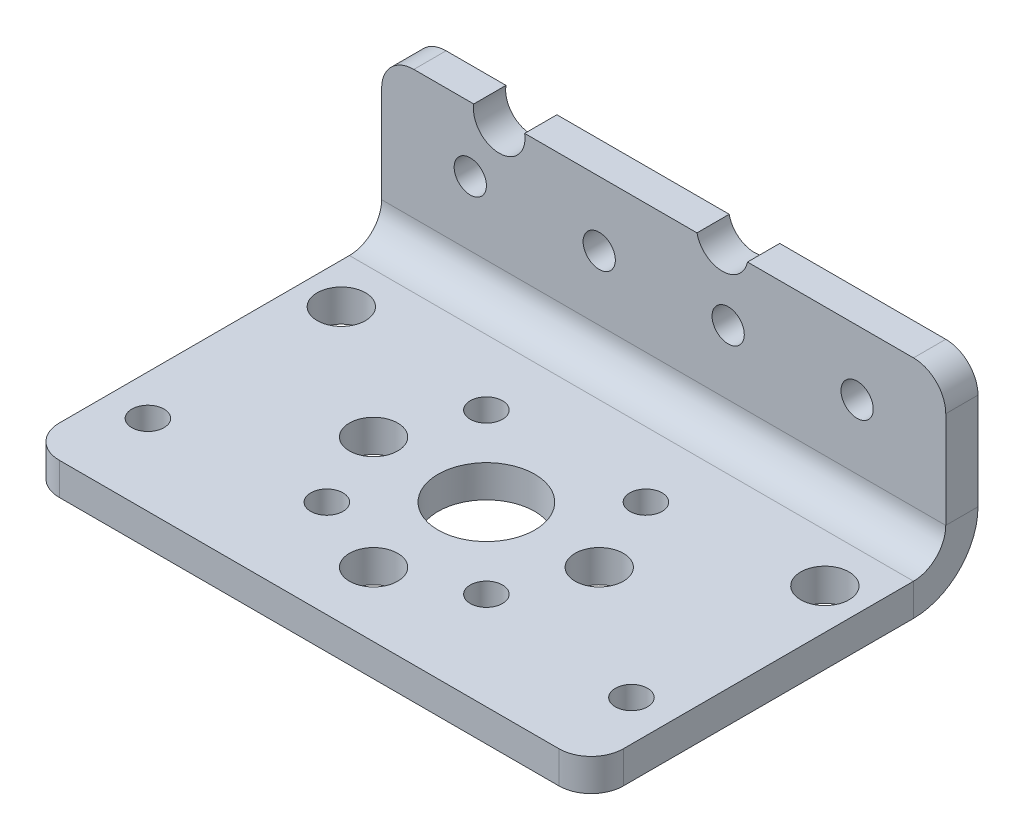
ISO-10303-21;
HEADER;
FILE_DESCRIPTION(('STEP AP214'),'2;1');
FILE_NAME('part.step','',(''),(''),'','','');
FILE_SCHEMA(('AUTOMOTIVE_DESIGN { 1 0 10303 214 1 1 1 1 }'));
ENDSEC;
DATA;
#1=APPLICATION_CONTEXT('core data for automotive mechanical design processes');
#2=APPLICATION_PROTOCOL_DEFINITION('international standard','automotive_design',2000,#1);
#3=PRODUCT_CONTEXT('',#1,'mechanical');
#4=PRODUCT('Part','Part','',(#3));
#5=PRODUCT_RELATED_PRODUCT_CATEGORY('part','',(#4));
#6=PRODUCT_DEFINITION_FORMATION('','',#4);
#7=PRODUCT_DEFINITION_CONTEXT('part definition',#1,'design');
#8=PRODUCT_DEFINITION('design','',#6,#7);
#9=PRODUCT_DEFINITION_SHAPE('','',#8);
#10=(LENGTH_UNIT() NAMED_UNIT(*) SI_UNIT(.MILLI.,.METRE.));
#11=(NAMED_UNIT(*) PLANE_ANGLE_UNIT() SI_UNIT($,.RADIAN.));
#12=(NAMED_UNIT(*) SI_UNIT($,.STERADIAN.) SOLID_ANGLE_UNIT());
#13=UNCERTAINTY_MEASURE_WITH_UNIT(LENGTH_MEASURE(1.E-05),#10,'distance_accuracy_value','');
#14=(GEOMETRIC_REPRESENTATION_CONTEXT(3) GLOBAL_UNCERTAINTY_ASSIGNED_CONTEXT((#13)) GLOBAL_UNIT_ASSIGNED_CONTEXT((#10,
#11,#12)) REPRESENTATION_CONTEXT('',''));
#15=CARTESIAN_POINT('',(0.,0.,0.));
#16=DIRECTION('',(0.,0.,1.));
#17=DIRECTION('',(1.,0.,0.));
#18=AXIS2_PLACEMENT_3D('',#15,#16,#17);
#19=CARTESIAN_POINT('',(17.5,6.,-2.));
#20=DIRECTION('',(0.,1.,0.));
#21=DIRECTION('',(-1.,0.,0.));
#22=AXIS2_PLACEMENT_3D('',#19,#20,#21);
#23=PLANE('',#22);
#24=DIRECTION('',(0.,0.,1.));
#25=VECTOR('',#24,1.);
#26=CARTESIAN_POINT('',(-11.7853192552786,6.,-10.));
#27=LINE('',#26,#25);
#28=CARTESIAN_POINT('',(-11.7853192552786,6.,-2.));
#29=VERTEX_POINT('',#28);
#30=CARTESIAN_POINT('',(-11.7853192552786,6.,0.));
#31=VERTEX_POINT('',#30);
#32=EDGE_CURVE('E13',#29,#31,#27,.T.);
#33=ORIENTED_EDGE('',*,*,#32,.F.);
#34=DIRECTION('',(-1.,0.,0.));
#35=VECTOR('',#34,1.);
#36=CARTESIAN_POINT('',(17.5,6.,-2.));
#37=LINE('',#36,#35);
#38=CARTESIAN_POINT('',(-15.5,6.,-2.));
#39=VERTEX_POINT('',#38);
#40=EDGE_CURVE('E293',#29,#39,#37,.T.);
#41=ORIENTED_EDGE('',*,*,#40,.T.);
#42=DIRECTION('',(0.,0.,1.));
#43=VECTOR('',#42,1.);
#44=CARTESIAN_POINT('',(-15.5,6.,-2.));
#45=LINE('',#44,#43);
#46=CARTESIAN_POINT('',(-15.5,6.,0.));
#47=VERTEX_POINT('',#46);
#48=EDGE_CURVE('E197',#39,#47,#45,.T.);
#49=ORIENTED_EDGE('',*,*,#48,.T.);
#50=DIRECTION('',(-1.,0.,0.));
#51=VECTOR('',#50,1.);
#52=CARTESIAN_POINT('',(17.5,6.,0.));
#53=LINE('',#52,#51);
#54=EDGE_CURVE('E188',#31,#47,#53,.T.);
#55=ORIENTED_EDGE('',*,*,#54,.F.);
#56=EDGE_LOOP('',(#33,#41,#49,#55));
#57=FACE_BOUND('',#56,.T.);
#58=ADVANCED_FACE('F58',(#57),#23,.T.);
#59=DIRECTION('',(0.,0.,1.));
#60=VECTOR('',#59,1.);
#61=CARTESIAN_POINT('',(-8.62658724936229,6.,-10.));
#62=LINE('',#61,#60);
#63=CARTESIAN_POINT('',(-8.62658724936229,6.,0.));
#64=VERTEX_POINT('',#63);
#65=CARTESIAN_POINT('',(-8.62658724936229,6.,-2.));
#66=VERTEX_POINT('',#65);
#67=EDGE_CURVE('E66',#64,#66,#62,.F.);
#68=ORIENTED_EDGE('',*,*,#67,.F.);
#69=CARTESIAN_POINT('',(2.06486456253236,6.,0.));
#70=VERTEX_POINT('',#69);
#71=EDGE_CURVE('E183',#70,#64,#53,.T.);
#72=ORIENTED_EDGE('',*,*,#71,.F.);
#73=DIRECTION('',(0.,0.,1.));
#74=VECTOR('',#73,1.);
#75=CARTESIAN_POINT('',(2.06486456253236,6.,-10.));
#76=LINE('',#75,#74);
#77=CARTESIAN_POINT('',(2.06486456253236,6.,-2.));
#78=VERTEX_POINT('',#77);
#79=EDGE_CURVE('E168',#78,#70,#76,.T.);
#80=ORIENTED_EDGE('',*,*,#79,.F.);
#81=EDGE_CURVE('E292',#78,#66,#37,.T.);
#82=ORIENTED_EDGE('',*,*,#81,.T.);
#83=EDGE_LOOP('',(#68,#72,#80,#82));
#84=FACE_BOUND('',#83,.T.);
#85=ADVANCED_FACE('F187',(#84),#23,.T.);
#86=CARTESIAN_POINT('',(17.5,-6.,-2.));
#87=DIRECTION('',(1.,0.,0.));
#88=DIRECTION('',(0.,0.,-1.));
#89=AXIS2_PLACEMENT_3D('',#86,#87,#88);
#90=PLANE('',#89);
#91=DIRECTION('',(0.,1.,0.));
#92=VECTOR('',#91,1.);
#93=CARTESIAN_POINT('',(17.5,-6.,-2.));
#94=LINE('',#93,#92);
#95=CARTESIAN_POINT('',(17.5,-2.,-2.));
#96=VERTEX_POINT('',#95);
#97=CARTESIAN_POINT('',(17.5,4.,-2.));
#98=VERTEX_POINT('',#97);
#99=EDGE_CURVE('E298',#96,#98,#94,.T.);
#100=ORIENTED_EDGE('',*,*,#99,.T.);
#101=DIRECTION('',(0.,0.,1.));
#102=VECTOR('',#101,1.);
#103=CARTESIAN_POINT('',(17.5,4.,-2.));
#104=LINE('',#103,#102);
#105=CARTESIAN_POINT('',(17.5,4.,0.));
#106=VERTEX_POINT('',#105);
#107=EDGE_CURVE('E212',#98,#106,#104,.T.);
#108=ORIENTED_EDGE('',*,*,#107,.T.);
#109=DIRECTION('',(0.,1.,0.));
#110=VECTOR('',#109,1.);
#111=CARTESIAN_POINT('',(17.5,-6.,0.));
#112=LINE('',#111,#110);
#113=CARTESIAN_POINT('',(17.5,-2.00000000000001,0.));
#114=VERTEX_POINT('',#113);
#115=EDGE_CURVE('E191',#114,#106,#112,.T.);
#116=ORIENTED_EDGE('',*,*,#115,.F.);
#117=DIRECTION('',(0.,0.,-1.));
#118=VECTOR('',#117,1.);
#119=CARTESIAN_POINT('',(17.5,-2.,0.));
#120=LINE('',#119,#118);
#121=EDGE_CURVE('E307',#114,#96,#120,.T.);
#122=ORIENTED_EDGE('',*,*,#121,.T.);
#123=EDGE_LOOP('',(#100,#108,#116,#122));
#124=FACE_BOUND('',#123,.T.);
#125=ADVANCED_FACE('F325',(#124),#90,.T.);
#126=CARTESIAN_POINT('',(0.,0.,-2.));
#127=DIRECTION('',(0.,0.,1.));
#128=DIRECTION('',(1.,0.,0.));
#129=AXIS2_PLACEMENT_3D('',#126,#127,#128);
#130=PLANE('',#129);
#131=CARTESIAN_POINT('',(-12.,2.,-2.));
#132=DIRECTION('',(0.,0.,-1.));
#133=DIRECTION('',(-1.,0.,0.));
#134=AXIS2_PLACEMENT_3D('',#131,#132,#133);
#135=CIRCLE('',#134,1.);
#136=CARTESIAN_POINT('',(-13.,2.,-2.));
#137=VERTEX_POINT('',#136);
#138=EDGE_CURVE('E376',#137,#137,#135,.T.);
#139=ORIENTED_EDGE('',*,*,#138,.F.);
#140=EDGE_LOOP('',(#139));
#141=FACE_BOUND('',#140,.T.);
#142=CARTESIAN_POINT('',(12.,2.00000000000002,-2.));
#143=DIRECTION('',(0.,0.,-1.));
#144=DIRECTION('',(1.,0.,0.));
#145=AXIS2_PLACEMENT_3D('',#142,#143,#144);
#146=CIRCLE('',#145,1.);
#147=CARTESIAN_POINT('',(13.,2.00000000000002,-2.));
#148=VERTEX_POINT('',#147);
#149=EDGE_CURVE('E375',#148,#148,#146,.T.);
#150=ORIENTED_EDGE('',*,*,#149,.F.);
#151=EDGE_LOOP('',(#150));
#152=FACE_BOUND('',#151,.T.);
#153=CARTESIAN_POINT('',(4.,2.00000000000001,-2.));
#154=DIRECTION('',(0.,0.,-1.));
#155=DIRECTION('',(1.,0.,0.));
#156=AXIS2_PLACEMENT_3D('',#153,#154,#155);
#157=CIRCLE('',#156,1.);
#158=CARTESIAN_POINT('',(5.,2.00000000000001,-2.));
#159=VERTEX_POINT('',#158);
#160=EDGE_CURVE('E284',#159,#159,#157,.T.);
#161=ORIENTED_EDGE('',*,*,#160,.F.);
#162=EDGE_LOOP('',(#161));
#163=FACE_BOUND('',#162,.T.);
#164=CARTESIAN_POINT('',(-4.,2.,-2.));
#165=DIRECTION('',(0.,0.,-1.));
#166=DIRECTION('',(-1.,0.,0.));
#167=AXIS2_PLACEMENT_3D('',#164,#165,#166);
#168=CIRCLE('',#167,1.);
#169=CARTESIAN_POINT('',(-5.,2.,-2.));
#170=VERTEX_POINT('',#169);
#171=EDGE_CURVE('E237',#170,#170,#168,.T.);
#172=ORIENTED_EDGE('',*,*,#171,.F.);
#173=EDGE_LOOP('',(#172));
#174=FACE_BOUND('',#173,.T.);
#175=ORIENTED_EDGE('',*,*,#40,.F.);
#176=CARTESIAN_POINT('',(-10.2059532523204,5.74386911802743,-2.));
#177=DIRECTION('',(0.,0.,1.));
#178=DIRECTION('',(1.,0.,0.));
#179=AXIS2_PLACEMENT_3D('',#176,#177,#178);
#180=CIRCLE('',#179,1.6);
#181=EDGE_CURVE('E287',#29,#66,#180,.T.);
#182=ORIENTED_EDGE('',*,*,#181,.T.);
#183=ORIENTED_EDGE('',*,*,#81,.F.);
#184=CARTESIAN_POINT('',(3.63175308280408,6.32382150181959,-2.));
#185=DIRECTION('',(0.,0.,1.));
#186=DIRECTION('',(1.,0.,0.));
#187=AXIS2_PLACEMENT_3D('',#184,#185,#186);
#188=CIRCLE('',#187,1.6);
#189=CARTESIAN_POINT('',(5.1986416030758,6.,-2.));
#190=VERTEX_POINT('',#189);
#191=EDGE_CURVE('E171',#78,#190,#188,.T.);
#192=ORIENTED_EDGE('',*,*,#191,.T.);
#193=CARTESIAN_POINT('',(15.5,6.,-2.));
#194=VERTEX_POINT('',#193);
#195=EDGE_CURVE('E198',#194,#190,#37,.T.);
#196=ORIENTED_EDGE('',*,*,#195,.F.);
#197=CARTESIAN_POINT('',(15.5,4.,-2.));
#198=DIRECTION('',(0.,0.,1.));
#199=DIRECTION('',(1.,0.,0.));
#200=AXIS2_PLACEMENT_3D('',#197,#198,#199);
#201=CIRCLE('',#200,2.);
#202=EDGE_CURVE('E207',#194,#98,#201,.F.);
#203=ORIENTED_EDGE('',*,*,#202,.T.);
#204=ORIENTED_EDGE('',*,*,#99,.F.);
#205=DIRECTION('',(1.,0.,0.));
#206=VECTOR('',#205,1.);
#207=CARTESIAN_POINT('',(17.5,-2.,-2.));
#208=LINE('',#207,#206);
#209=CARTESIAN_POINT('',(-17.5,-1.99999999999999,-2.));
#210=VERTEX_POINT('',#209);
#211=EDGE_CURVE('E409',#96,#210,#208,.F.);
#212=ORIENTED_EDGE('',*,*,#211,.T.);
#213=DIRECTION('',(0.,-1.,0.));
#214=VECTOR('',#213,1.);
#215=CARTESIAN_POINT('',(-17.5,-6.,-2.));
#216=LINE('',#215,#214);
#217=CARTESIAN_POINT('',(-17.5,4.,-2.));
#218=VERTEX_POINT('',#217);
#219=EDGE_CURVE('E190',#218,#210,#216,.T.);
#220=ORIENTED_EDGE('',*,*,#219,.F.);
#221=CARTESIAN_POINT('',(-15.5,4.,-2.));
#222=DIRECTION('',(0.,0.,1.));
#223=DIRECTION('',(1.,0.,0.));
#224=AXIS2_PLACEMENT_3D('',#221,#222,#223);
#225=CIRCLE('',#224,2.);
#226=EDGE_CURVE('E209',#218,#39,#225,.F.);
#227=ORIENTED_EDGE('',*,*,#226,.T.);
#228=EDGE_LOOP('',(#175,#182,#183,#192,#196,#203,#204,#212,#220,#227));
#229=FACE_BOUND('',#228,.T.);
#230=ADVANCED_FACE('F291',(#141,#152,#163,#174,#229),#130,.F.);
#231=CARTESIAN_POINT('',(0.,0.,0.));
#232=DIRECTION('',(0.,0.,1.));
#233=DIRECTION('',(1.,0.,0.));
#234=AXIS2_PLACEMENT_3D('',#231,#232,#233);
#235=PLANE('',#234);
#236=CARTESIAN_POINT('',(-10.2059532523204,5.74386911802743,0.));
#237=DIRECTION('',(0.,0.,1.));
#238=DIRECTION('',(1.,0.,0.));
#239=AXIS2_PLACEMENT_3D('',#236,#237,#238);
#240=CIRCLE('',#239,1.6);
#241=EDGE_CURVE('E72',#31,#64,#240,.T.);
#242=ORIENTED_EDGE('',*,*,#241,.F.);
#243=ORIENTED_EDGE('',*,*,#54,.T.);
#244=CARTESIAN_POINT('',(-15.5,4.,0.));
#245=DIRECTION('',(0.,0.,1.));
#246=DIRECTION('',(1.,0.,0.));
#247=AXIS2_PLACEMENT_3D('',#244,#245,#246);
#248=CIRCLE('',#247,2.);
#249=CARTESIAN_POINT('',(-17.5,4.,0.));
#250=VERTEX_POINT('',#249);
#251=EDGE_CURVE('E203',#47,#250,#248,.T.);
#252=ORIENTED_EDGE('',*,*,#251,.T.);
#253=DIRECTION('',(0.,-1.,0.));
#254=VECTOR('',#253,1.);
#255=CARTESIAN_POINT('',(-17.5,-6.,0.));
#256=LINE('',#255,#254);
#257=CARTESIAN_POINT('',(-17.5,-2.00000000000001,0.));
#258=VERTEX_POINT('',#257);
#259=EDGE_CURVE('E301',#250,#258,#256,.T.);
#260=ORIENTED_EDGE('',*,*,#259,.T.);
#261=DIRECTION('',(1.,0.,0.));
#262=VECTOR('',#261,1.);
#263=CARTESIAN_POINT('',(17.5,-2.,0.));
#264=LINE('',#263,#262);
#265=EDGE_CURVE('E417',#114,#258,#264,.F.);
#266=ORIENTED_EDGE('',*,*,#265,.F.);
#267=ORIENTED_EDGE('',*,*,#115,.T.);
#268=CARTESIAN_POINT('',(15.5,4.,0.));
#269=DIRECTION('',(0.,0.,1.));
#270=DIRECTION('',(1.,0.,0.));
#271=AXIS2_PLACEMENT_3D('',#268,#269,#270);
#272=CIRCLE('',#271,2.);
#273=CARTESIAN_POINT('',(15.5,6.,0.));
#274=VERTEX_POINT('',#273);
#275=EDGE_CURVE('E201',#106,#274,#272,.T.);
#276=ORIENTED_EDGE('',*,*,#275,.T.);
#277=CARTESIAN_POINT('',(5.1986416030758,6.,0.));
#278=VERTEX_POINT('',#277);
#279=EDGE_CURVE('E185',#274,#278,#53,.T.);
#280=ORIENTED_EDGE('',*,*,#279,.T.);
#281=CARTESIAN_POINT('',(3.63175308280408,6.32382150181959,0.));
#282=DIRECTION('',(0.,0.,1.));
#283=DIRECTION('',(1.,0.,0.));
#284=AXIS2_PLACEMENT_3D('',#281,#282,#283);
#285=CIRCLE('',#284,1.6);
#286=EDGE_CURVE('E80',#70,#278,#285,.T.);
#287=ORIENTED_EDGE('',*,*,#286,.F.);
#288=ORIENTED_EDGE('',*,*,#71,.T.);
#289=EDGE_LOOP('',(#242,#243,#252,#260,#266,#267,#276,#280,#287,#288));
#290=FACE_BOUND('',#289,.T.);
#291=CARTESIAN_POINT('',(-12.,2.,0.));
#292=DIRECTION('',(0.,0.,1.));
#293=DIRECTION('',(1.,0.,0.));
#294=AXIS2_PLACEMENT_3D('',#291,#292,#293);
#295=CIRCLE('',#294,1.);
#296=CARTESIAN_POINT('',(-11.,2.,0.));
#297=VERTEX_POINT('',#296);
#298=EDGE_CURVE('E243',#297,#297,#295,.T.);
#299=ORIENTED_EDGE('',*,*,#298,.F.);
#300=EDGE_LOOP('',(#299));
#301=FACE_BOUND('',#300,.T.);
#302=CARTESIAN_POINT('',(12.,2.00000000000002,0.));
#303=DIRECTION('',(0.,0.,1.));
#304=DIRECTION('',(1.,0.,0.));
#305=AXIS2_PLACEMENT_3D('',#302,#303,#304);
#306=CIRCLE('',#305,1.);
#307=CARTESIAN_POINT('',(13.,2.00000000000002,0.));
#308=VERTEX_POINT('',#307);
#309=EDGE_CURVE('E240',#308,#308,#306,.T.);
#310=ORIENTED_EDGE('',*,*,#309,.F.);
#311=EDGE_LOOP('',(#310));
#312=FACE_BOUND('',#311,.T.);
#313=CARTESIAN_POINT('',(4.,2.00000000000001,0.));
#314=DIRECTION('',(0.,0.,1.));
#315=DIRECTION('',(1.,0.,0.));
#316=AXIS2_PLACEMENT_3D('',#313,#314,#315);
#317=CIRCLE('',#316,1.);
#318=CARTESIAN_POINT('',(5.,2.00000000000001,0.));
#319=VERTEX_POINT('',#318);
#320=EDGE_CURVE('E236',#319,#319,#317,.T.);
#321=ORIENTED_EDGE('',*,*,#320,.F.);
#322=EDGE_LOOP('',(#321));
#323=FACE_BOUND('',#322,.T.);
#324=CARTESIAN_POINT('',(-4.,2.,0.));
#325=DIRECTION('',(0.,0.,1.));
#326=DIRECTION('',(1.,0.,0.));
#327=AXIS2_PLACEMENT_3D('',#324,#325,#326);
#328=CIRCLE('',#327,1.);
#329=CARTESIAN_POINT('',(-3.,2.,0.));
#330=VERTEX_POINT('',#329);
#331=EDGE_CURVE('E233',#330,#330,#328,.T.);
#332=ORIENTED_EDGE('',*,*,#331,.F.);
#333=EDGE_LOOP('',(#332));
#334=FACE_BOUND('',#333,.T.);
#335=ADVANCED_FACE('F181',(#290,#301,#312,#323,#334),#235,.T.);
#336=CARTESIAN_POINT('',(-17.5,-6.,-2.));
#337=DIRECTION('',(-1.,0.,0.));
#338=DIRECTION('',(0.,0.,1.));
#339=AXIS2_PLACEMENT_3D('',#336,#337,#338);
#340=PLANE('',#339);
#341=ORIENTED_EDGE('',*,*,#259,.F.);
#342=DIRECTION('',(0.,0.,1.));
#343=VECTOR('',#342,1.);
#344=CARTESIAN_POINT('',(-17.5,4.,-2.));
#345=LINE('',#344,#343);
#346=EDGE_CURVE('E205',#250,#218,#345,.F.);
#347=ORIENTED_EDGE('',*,*,#346,.T.);
#348=ORIENTED_EDGE('',*,*,#219,.T.);
#349=DIRECTION('',(0.,0.,-1.));
#350=VECTOR('',#349,1.);
#351=CARTESIAN_POINT('',(-17.5,-2.00000000000001,0.));
#352=LINE('',#351,#350);
#353=EDGE_CURVE('E302',#258,#210,#352,.T.);
#354=ORIENTED_EDGE('',*,*,#353,.F.);
#355=EDGE_LOOP('',(#341,#347,#348,#354));
#356=FACE_BOUND('',#355,.T.);
#357=ADVANCED_FACE('F465',(#356),#340,.T.);
#358=DIRECTION('',(0.,0.,1.));
#359=VECTOR('',#358,1.);
#360=CARTESIAN_POINT('',(5.1986416030758,6.,-10.));
#361=LINE('',#360,#359);
#362=EDGE_CURVE('E176',#278,#190,#361,.F.);
#363=ORIENTED_EDGE('',*,*,#362,.F.);
#364=ORIENTED_EDGE('',*,*,#279,.F.);
#365=DIRECTION('',(0.,0.,1.));
#366=VECTOR('',#365,1.);
#367=CARTESIAN_POINT('',(15.5,6.,-2.));
#368=LINE('',#367,#366);
#369=EDGE_CURVE('E195',#274,#194,#368,.F.);
#370=ORIENTED_EDGE('',*,*,#369,.T.);
#371=ORIENTED_EDGE('',*,*,#195,.T.);
#372=EDGE_LOOP('',(#363,#364,#370,#371));
#373=FACE_BOUND('',#372,.T.);
#374=ADVANCED_FACE('F334',(#373),#23,.T.);
#375=CARTESIAN_POINT('',(-17.5,-2.00000000000001,2.));
#376=DIRECTION('',(-1.,0.,0.));
#377=DIRECTION('',(0.,-1.,0.));
#378=AXIS2_PLACEMENT_3D('',#375,#376,#377);
#379=PLANE('',#378);
#380=DIRECTION('',(0.,1.,0.));
#381=VECTOR('',#380,1.);
#382=CARTESIAN_POINT('',(-17.5,-6.00000000000001,1.99999999999999));
#383=LINE('',#382,#381);
#384=CARTESIAN_POINT('',(-17.5,-4.00000000000001,1.99999999999999));
#385=VERTEX_POINT('',#384);
#386=CARTESIAN_POINT('',(-17.5,-6.00000000000001,1.99999999999999));
#387=VERTEX_POINT('',#386);
#388=EDGE_CURVE('E246',#385,#387,#383,.F.);
#389=ORIENTED_EDGE('',*,*,#388,.F.);
#390=CARTESIAN_POINT('',(-17.5,-2.00000000000001,2.));
#391=DIRECTION('',(1.,0.,0.));
#392=DIRECTION('',(0.,1.,0.));
#393=AXIS2_PLACEMENT_3D('',#390,#391,#392);
#394=CIRCLE('',#393,2.);
#395=EDGE_CURVE('E415',#258,#385,#394,.F.);
#396=ORIENTED_EDGE('',*,*,#395,.F.);
#397=ORIENTED_EDGE('',*,*,#353,.T.);
#398=CARTESIAN_POINT('',(-17.5,-2.00000000000001,2.));
#399=DIRECTION('',(1.,0.,0.));
#400=DIRECTION('',(0.,1.,0.));
#401=AXIS2_PLACEMENT_3D('',#398,#399,#400);
#402=CIRCLE('',#401,4.);
#403=EDGE_CURVE('E314',#210,#387,#402,.F.);
#404=ORIENTED_EDGE('',*,*,#403,.T.);
#405=EDGE_LOOP('',(#389,#396,#397,#404));
#406=FACE_BOUND('',#405,.T.);
#407=ADVANCED_FACE('F456',(#406),#379,.T.);
#408=CARTESIAN_POINT('',(17.5,-2.,2.));
#409=DIRECTION('',(-1.,0.,0.));
#410=DIRECTION('',(0.,-1.,0.));
#411=AXIS2_PLACEMENT_3D('',#408,#409,#410);
#412=PLANE('',#411);
#413=CARTESIAN_POINT('',(17.5,-2.,2.));
#414=DIRECTION('',(1.,0.,0.));
#415=DIRECTION('',(0.,1.,0.));
#416=AXIS2_PLACEMENT_3D('',#413,#414,#415);
#417=CIRCLE('',#416,2.);
#418=CARTESIAN_POINT('',(17.5,-4.00000000000001,1.99999999999999));
#419=VERTEX_POINT('',#418);
#420=EDGE_CURVE('E317',#419,#114,#417,.T.);
#421=ORIENTED_EDGE('',*,*,#420,.F.);
#422=DIRECTION('',(0.,1.,0.));
#423=VECTOR('',#422,1.);
#424=CARTESIAN_POINT('',(17.5,-4.,1.99999999999999));
#425=LINE('',#424,#423);
#426=CARTESIAN_POINT('',(17.5,-6.00000000000001,1.99999999999999));
#427=VERTEX_POINT('',#426);
#428=EDGE_CURVE('E402',#419,#427,#425,.F.);
#429=ORIENTED_EDGE('',*,*,#428,.T.);
#430=CARTESIAN_POINT('',(17.5,-2.,2.));
#431=DIRECTION('',(1.,0.,0.));
#432=DIRECTION('',(0.,1.,0.));
#433=AXIS2_PLACEMENT_3D('',#430,#431,#432);
#434=CIRCLE('',#433,4.);
#435=EDGE_CURVE('E411',#427,#96,#434,.T.);
#436=ORIENTED_EDGE('',*,*,#435,.T.);
#437=ORIENTED_EDGE('',*,*,#121,.F.);
#438=EDGE_LOOP('',(#421,#429,#436,#437));
#439=FACE_BOUND('',#438,.T.);
#440=ADVANCED_FACE('F426',(#439),#412,.F.);
#441=CARTESIAN_POINT('',(17.5,-2.,2.));
#442=DIRECTION('',(1.,0.,0.));
#443=DIRECTION('',(0.,-1.,0.));
#444=AXIS2_PLACEMENT_3D('',#441,#442,#443);
#445=CYLINDRICAL_SURFACE('',#444,4.);
#446=ORIENTED_EDGE('',*,*,#211,.F.);
#447=ORIENTED_EDGE('',*,*,#435,.F.);
#448=DIRECTION('',(1.,0.,0.));
#449=VECTOR('',#448,1.);
#450=CARTESIAN_POINT('',(-17.5,-6.00000000000001,1.99999999999999));
#451=LINE('',#450,#449);
#452=EDGE_CURVE('E399',#427,#387,#451,.F.);
#453=ORIENTED_EDGE('',*,*,#452,.T.);
#454=ORIENTED_EDGE('',*,*,#403,.F.);
#455=EDGE_LOOP('',(#446,#447,#453,#454));
#456=FACE_BOUND('',#455,.T.);
#457=ADVANCED_FACE('F455',(#456),#445,.T.);
#458=CARTESIAN_POINT('',(17.5,-2.,2.));
#459=DIRECTION('',(1.,0.,0.));
#460=DIRECTION('',(0.,-1.,0.));
#461=AXIS2_PLACEMENT_3D('',#458,#459,#460);
#462=CYLINDRICAL_SURFACE('',#461,2.);
#463=ORIENTED_EDGE('',*,*,#265,.T.);
#464=ORIENTED_EDGE('',*,*,#395,.T.);
#465=DIRECTION('',(1.,0.,0.));
#466=VECTOR('',#465,1.);
#467=CARTESIAN_POINT('',(-17.5,-4.00000000000001,1.99999999999999));
#468=LINE('',#467,#466);
#469=EDGE_CURVE('E405',#385,#419,#468,.T.);
#470=ORIENTED_EDGE('',*,*,#469,.T.);
#471=ORIENTED_EDGE('',*,*,#420,.T.);
#472=EDGE_LOOP('',(#463,#464,#470,#471));
#473=FACE_BOUND('',#472,.T.);
#474=ADVANCED_FACE('F422',(#473),#462,.F.);
#475=CARTESIAN_POINT('',(17.5,-6.00000000000007,22.));
#476=DIRECTION('',(-1.,0.,0.));
#477=DIRECTION('',(0.,-1.,0.));
#478=AXIS2_PLACEMENT_3D('',#475,#476,#477);
#479=PLANE('',#478);
#480=DIRECTION('',(0.,0.,-1.));
#481=VECTOR('',#480,1.);
#482=CARTESIAN_POINT('',(17.5,-4.00000000000007,22.));
#483=LINE('',#482,#481);
#484=CARTESIAN_POINT('',(17.5,-4.00000000000007,20.));
#485=VERTEX_POINT('',#484);
#486=EDGE_CURVE('E396',#419,#485,#483,.F.);
#487=ORIENTED_EDGE('',*,*,#486,.T.);
#488=DIRECTION('',(0.,1.,0.));
#489=VECTOR('',#488,1.);
#490=CARTESIAN_POINT('',(17.5,-6.00000000000007,20.));
#491=LINE('',#490,#489);
#492=CARTESIAN_POINT('',(17.5,-6.00000000000007,20.));
#493=VERTEX_POINT('',#492);
#494=EDGE_CURVE('E224',#485,#493,#491,.F.);
#495=ORIENTED_EDGE('',*,*,#494,.T.);
#496=DIRECTION('',(0.,0.,1.));
#497=VECTOR('',#496,1.);
#498=CARTESIAN_POINT('',(17.5,-6.,0.));
#499=LINE('',#498,#497);
#500=EDGE_CURVE('E388',#427,#493,#499,.T.);
#501=ORIENTED_EDGE('',*,*,#500,.F.);
#502=ORIENTED_EDGE('',*,*,#428,.F.);
#503=EDGE_LOOP('',(#487,#495,#501,#502));
#504=FACE_BOUND('',#503,.T.);
#505=ADVANCED_FACE('F431',(#504),#479,.F.);
#506=CARTESIAN_POINT('',(-17.5,-6.,0.));
#507=DIRECTION('',(1.,0.,0.));
#508=DIRECTION('',(0.,1.,0.));
#509=AXIS2_PLACEMENT_3D('',#506,#507,#508);
#510=PLANE('',#509);
#511=DIRECTION('',(0.,0.,-1.));
#512=VECTOR('',#511,1.);
#513=CARTESIAN_POINT('',(-17.5,-6.,0.));
#514=LINE('',#513,#512);
#515=CARTESIAN_POINT('',(-17.5,-6.00000000000007,20.));
#516=VERTEX_POINT('',#515);
#517=EDGE_CURVE('E383',#516,#387,#514,.T.);
#518=ORIENTED_EDGE('',*,*,#517,.F.);
#519=DIRECTION('',(0.,1.,0.));
#520=VECTOR('',#519,1.);
#521=CARTESIAN_POINT('',(-17.5,-6.00000000000007,20.));
#522=LINE('',#521,#520);
#523=CARTESIAN_POINT('',(-17.5,-4.00000000000007,20.));
#524=VERTEX_POINT('',#523);
#525=EDGE_CURVE('E230',#516,#524,#522,.T.);
#526=ORIENTED_EDGE('',*,*,#525,.T.);
#527=DIRECTION('',(0.,0.,1.));
#528=VECTOR('',#527,1.);
#529=CARTESIAN_POINT('',(-17.5,-4.,0.));
#530=LINE('',#529,#528);
#531=EDGE_CURVE('E391',#524,#385,#530,.F.);
#532=ORIENTED_EDGE('',*,*,#531,.T.);
#533=ORIENTED_EDGE('',*,*,#388,.T.);
#534=EDGE_LOOP('',(#518,#526,#532,#533));
#535=FACE_BOUND('',#534,.T.);
#536=ADVANCED_FACE('F452',(#535),#510,.F.);
#537=CARTESIAN_POINT('',(0.,-6.,0.));
#538=DIRECTION('',(0.,1.,0.));
#539=DIRECTION('',(0.,0.,1.));
#540=AXIS2_PLACEMENT_3D('',#537,#538,#539);
#541=PLANE('',#540);
#542=CARTESIAN_POINT('',(15.,-6.00000000000002,5.));
#543=DIRECTION('',(0.,-1.,0.));
#544=DIRECTION('',(0.,0.,1.));
#545=AXIS2_PLACEMENT_3D('',#542,#543,#544);
#546=CIRCLE('',#545,1.5);
#547=CARTESIAN_POINT('',(15.,-6.00000000000002,6.5));
#548=VERTEX_POINT('',#547);
#549=EDGE_CURVE('E342',#548,#548,#546,.T.);
#550=ORIENTED_EDGE('',*,*,#549,.F.);
#551=EDGE_LOOP('',(#550));
#552=FACE_BOUND('',#551,.T.);
#553=CARTESIAN_POINT('',(15.,-6.00000000000006,17.));
#554=DIRECTION('',(0.,-1.,0.));
#555=DIRECTION('',(0.,0.,1.));
#556=AXIS2_PLACEMENT_3D('',#553,#554,#555);
#557=CIRCLE('',#556,1.);
#558=CARTESIAN_POINT('',(15.,-6.00000000000006,18.));
#559=VERTEX_POINT('',#558);
#560=EDGE_CURVE('E355',#559,#559,#557,.T.);
#561=ORIENTED_EDGE('',*,*,#560,.F.);
#562=EDGE_LOOP('',(#561));
#563=FACE_BOUND('',#562,.T.);
#564=CARTESIAN_POINT('',(0.,-6.00000000000006,18.));
#565=DIRECTION('',(0.,-1.,0.));
#566=DIRECTION('',(0.,0.,-1.));
#567=AXIS2_PLACEMENT_3D('',#564,#565,#566);
#568=CIRCLE('',#567,1.5);
#569=CARTESIAN_POINT('',(0.,-6.00000000000006,16.5));
#570=VERTEX_POINT('',#569);
#571=EDGE_CURVE('E352',#570,#570,#568,.T.);
#572=ORIENTED_EDGE('',*,*,#571,.F.);
#573=EDGE_LOOP('',(#572));
#574=FACE_BOUND('',#573,.T.);
#575=CARTESIAN_POINT('',(-4.94974746830585,-6.00000000000002,6.05025253169418));
#576=DIRECTION('',(0.,-1.,0.));
#577=DIRECTION('',(0.,0.,-1.));
#578=AXIS2_PLACEMENT_3D('',#575,#576,#577);
#579=CIRCLE('',#578,0.999999999999999);
#580=CARTESIAN_POINT('',(-4.94974746830585,-6.00000000000002,5.05025253169418));
#581=VERTEX_POINT('',#580);
#582=EDGE_CURVE('E348',#581,#581,#579,.T.);
#583=ORIENTED_EDGE('',*,*,#582,.F.);
#584=EDGE_LOOP('',(#583));
#585=FACE_BOUND('',#584,.T.);
#586=CARTESIAN_POINT('',(-4.94974746830586,-6.00000000000006,15.9497474683058));
#587=DIRECTION('',(0.,-1.,0.));
#588=DIRECTION('',(0.,0.,-1.));
#589=AXIS2_PLACEMENT_3D('',#586,#587,#588);
#590=CIRCLE('',#589,0.999999999999999);
#591=CARTESIAN_POINT('',(-4.94974746830586,-6.00000000000005,14.9497474683058));
#592=VERTEX_POINT('',#591);
#593=EDGE_CURVE('E351',#592,#592,#590,.T.);
#594=ORIENTED_EDGE('',*,*,#593,.F.);
#595=EDGE_LOOP('',(#594));
#596=FACE_BOUND('',#595,.T.);
#597=CARTESIAN_POINT('',(-15.,-6.00000000000006,17.));
#598=DIRECTION('',(0.,-1.,0.));
#599=DIRECTION('',(0.,0.,-1.));
#600=AXIS2_PLACEMENT_3D('',#597,#598,#599);
#601=CIRCLE('',#600,1.);
#602=CARTESIAN_POINT('',(-15.,-6.00000000000006,16.));
#603=VERTEX_POINT('',#602);
#604=EDGE_CURVE('E366',#603,#603,#601,.T.);
#605=ORIENTED_EDGE('',*,*,#604,.F.);
#606=EDGE_LOOP('',(#605));
#607=FACE_BOUND('',#606,.T.);
#608=CARTESIAN_POINT('',(-15.,-6.00000000000002,4.99999999999998));
#609=DIRECTION('',(0.,-1.,0.));
#610=DIRECTION('',(0.,0.,-1.));
#611=AXIS2_PLACEMENT_3D('',#608,#609,#610);
#612=CIRCLE('',#611,1.5);
#613=CARTESIAN_POINT('',(-15.,-6.00000000000001,3.49999999999998));
#614=VERTEX_POINT('',#613);
#615=EDGE_CURVE('E363',#614,#614,#612,.T.);
#616=ORIENTED_EDGE('',*,*,#615,.F.);
#617=EDGE_LOOP('',(#616));
#618=FACE_BOUND('',#617,.T.);
#619=CARTESIAN_POINT('',(-7.,-6.00000000000004,11.));
#620=DIRECTION('',(0.,-1.,0.));
#621=DIRECTION('',(0.,0.,-1.));
#622=AXIS2_PLACEMENT_3D('',#619,#620,#621);
#623=CIRCLE('',#622,1.5);
#624=CARTESIAN_POINT('',(-7.,-6.00000000000003,9.49999999999998));
#625=VERTEX_POINT('',#624);
#626=EDGE_CURVE('E360',#625,#625,#623,.T.);
#627=ORIENTED_EDGE('',*,*,#626,.F.);
#628=EDGE_LOOP('',(#627));
#629=FACE_BOUND('',#628,.T.);
#630=CARTESIAN_POINT('',(4.94974746830586,-6.00000000000002,6.05025253169419));
#631=DIRECTION('',(0.,-1.,0.));
#632=DIRECTION('',(0.,0.,1.));
#633=AXIS2_PLACEMENT_3D('',#630,#631,#632);
#634=CIRCLE('',#633,0.999999999999999);
#635=CARTESIAN_POINT('',(4.94974746830586,-6.00000000000002,7.05025253169418));
#636=VERTEX_POINT('',#635);
#637=EDGE_CURVE('E339',#636,#636,#634,.T.);
#638=ORIENTED_EDGE('',*,*,#637,.F.);
#639=EDGE_LOOP('',(#638));
#640=FACE_BOUND('',#639,.T.);
#641=CARTESIAN_POINT('',(7.,-6.00000000000004,11.));
#642=DIRECTION('',(0.,-1.,0.));
#643=DIRECTION('',(0.,0.,1.));
#644=AXIS2_PLACEMENT_3D('',#641,#642,#643);
#645=CIRCLE('',#644,1.5);
#646=CARTESIAN_POINT('',(7.,-6.00000000000004,12.5));
#647=VERTEX_POINT('',#646);
#648=EDGE_CURVE('E343',#647,#647,#645,.T.);
#649=ORIENTED_EDGE('',*,*,#648,.F.);
#650=EDGE_LOOP('',(#649));
#651=FACE_BOUND('',#650,.T.);
#652=CARTESIAN_POINT('',(4.94974746830586,-6.00000000000006,15.9497474683058));
#653=DIRECTION('',(0.,-1.,0.));
#654=DIRECTION('',(0.,0.,1.));
#655=AXIS2_PLACEMENT_3D('',#652,#653,#654);
#656=CIRCLE('',#655,0.999999999999999);
#657=CARTESIAN_POINT('',(4.94974746830586,-6.00000000000006,16.9497474683058));
#658=VERTEX_POINT('',#657);
#659=EDGE_CURVE('E294',#658,#658,#656,.T.);
#660=ORIENTED_EDGE('',*,*,#659,.F.);
#661=EDGE_LOOP('',(#660));
#662=FACE_BOUND('',#661,.T.);
#663=CARTESIAN_POINT('',(0.,-6.00000000000004,11.));
#664=DIRECTION('',(0.,-1.,0.));
#665=DIRECTION('',(0.,0.,-1.));
#666=AXIS2_PLACEMENT_3D('',#663,#664,#665);
#667=CIRCLE('',#666,3.);
#668=CARTESIAN_POINT('',(0.,-6.00000000000003,7.99999999999998));
#669=VERTEX_POINT('',#668);
#670=EDGE_CURVE('E251',#669,#669,#667,.T.);
#671=ORIENTED_EDGE('',*,*,#670,.F.);
#672=EDGE_LOOP('',(#671));
#673=FACE_BOUND('',#672,.T.);
#674=ORIENTED_EDGE('',*,*,#500,.T.);
#675=CARTESIAN_POINT('',(15.5,-6.00000000000007,20.));
#676=DIRECTION('',(0.,1.,0.));
#677=DIRECTION('',(0.,0.,1.));
#678=AXIS2_PLACEMENT_3D('',#675,#676,#677);
#679=CIRCLE('',#678,2.);
#680=CARTESIAN_POINT('',(15.5,-6.00000000000007,22.));
#681=VERTEX_POINT('',#680);
#682=EDGE_CURVE('E228',#493,#681,#679,.F.);
#683=ORIENTED_EDGE('',*,*,#682,.T.);
#684=DIRECTION('',(-1.,0.,0.));
#685=VECTOR('',#684,1.);
#686=CARTESIAN_POINT('',(0.,-6.00000000000008,22.));
#687=LINE('',#686,#685);
#688=CARTESIAN_POINT('',(-15.5,-6.00000000000008,22.));
#689=VERTEX_POINT('',#688);
#690=EDGE_CURVE('E385',#681,#689,#687,.T.);
#691=ORIENTED_EDGE('',*,*,#690,.T.);
#692=CARTESIAN_POINT('',(-15.5,-6.00000000000007,20.));
#693=DIRECTION('',(0.,1.,0.));
#694=DIRECTION('',(0.,0.,1.));
#695=AXIS2_PLACEMENT_3D('',#692,#693,#694);
#696=CIRCLE('',#695,2.);
#697=EDGE_CURVE('E226',#689,#516,#696,.F.);
#698=ORIENTED_EDGE('',*,*,#697,.T.);
#699=ORIENTED_EDGE('',*,*,#517,.T.);
#700=ORIENTED_EDGE('',*,*,#452,.F.);
#701=EDGE_LOOP('',(#674,#683,#691,#698,#699,#700));
#702=FACE_BOUND('',#701,.T.);
#703=ADVANCED_FACE('F447',(#552,#563,#574,#585,#596,#607,#618,#629,#640,#651,#662,#673,#702),
#541,.F.);
#704=CARTESIAN_POINT('',(0.,-4.,0.));
#705=DIRECTION('',(0.,1.,0.));
#706=DIRECTION('',(0.,0.,1.));
#707=AXIS2_PLACEMENT_3D('',#704,#705,#706);
#708=PLANE('',#707);
#709=CARTESIAN_POINT('',(15.,-4.00000000000001,5.));
#710=DIRECTION('',(0.,1.,0.));
#711=DIRECTION('',(0.,0.,1.));
#712=AXIS2_PLACEMENT_3D('',#709,#710,#711);
#713=CIRCLE('',#712,1.5);
#714=CARTESIAN_POINT('',(15.,-4.00000000000002,6.5));
#715=VERTEX_POINT('',#714);
#716=EDGE_CURVE('E281',#715,#715,#713,.T.);
#717=ORIENTED_EDGE('',*,*,#716,.F.);
#718=EDGE_LOOP('',(#717));
#719=FACE_BOUND('',#718,.T.);
#720=CARTESIAN_POINT('',(15.,-4.00000000000006,17.));
#721=DIRECTION('',(0.,1.,0.));
#722=DIRECTION('',(0.,0.,1.));
#723=AXIS2_PLACEMENT_3D('',#720,#721,#722);
#724=CIRCLE('',#723,1.);
#725=CARTESIAN_POINT('',(15.,-4.00000000000006,18.));
#726=VERTEX_POINT('',#725);
#727=EDGE_CURVE('E278',#726,#726,#724,.T.);
#728=ORIENTED_EDGE('',*,*,#727,.F.);
#729=EDGE_LOOP('',(#728));
#730=FACE_BOUND('',#729,.T.);
#731=CARTESIAN_POINT('',(0.,-4.00000000000006,18.));
#732=DIRECTION('',(0.,1.,0.));
#733=DIRECTION('',(0.,0.,1.));
#734=AXIS2_PLACEMENT_3D('',#731,#732,#733);
#735=CIRCLE('',#734,1.5);
#736=CARTESIAN_POINT('',(0.,-4.00000000000007,19.5));
#737=VERTEX_POINT('',#736);
#738=EDGE_CURVE('E275',#737,#737,#735,.T.);
#739=ORIENTED_EDGE('',*,*,#738,.F.);
#740=EDGE_LOOP('',(#739));
#741=FACE_BOUND('',#740,.T.);
#742=CARTESIAN_POINT('',(-4.94974746830585,-4.00000000000002,6.05025253169419));
#743=DIRECTION('',(0.,1.,0.));
#744=DIRECTION('',(0.,0.,1.));
#745=AXIS2_PLACEMENT_3D('',#742,#743,#744);
#746=CIRCLE('',#745,0.999999999999999);
#747=CARTESIAN_POINT('',(-4.94974746830585,-4.00000000000002,7.05025253169418));
#748=VERTEX_POINT('',#747);
#749=EDGE_CURVE('E272',#748,#748,#746,.T.);
#750=ORIENTED_EDGE('',*,*,#749,.F.);
#751=EDGE_LOOP('',(#750));
#752=FACE_BOUND('',#751,.T.);
#753=CARTESIAN_POINT('',(-4.94974746830586,-4.00000000000006,15.9497474683058));
#754=DIRECTION('',(0.,1.,0.));
#755=DIRECTION('',(0.,0.,1.));
#756=AXIS2_PLACEMENT_3D('',#753,#754,#755);
#757=CIRCLE('',#756,0.999999999999999);
#758=CARTESIAN_POINT('',(-4.94974746830586,-4.00000000000006,16.9497474683058));
#759=VERTEX_POINT('',#758);
#760=EDGE_CURVE('E269',#759,#759,#757,.T.);
#761=ORIENTED_EDGE('',*,*,#760,.F.);
#762=EDGE_LOOP('',(#761));
#763=FACE_BOUND('',#762,.T.);
#764=CARTESIAN_POINT('',(-15.,-4.00000000000006,17.));
#765=DIRECTION('',(0.,1.,0.));
#766=DIRECTION('',(0.,0.,1.));
#767=AXIS2_PLACEMENT_3D('',#764,#765,#766);
#768=CIRCLE('',#767,1.);
#769=CARTESIAN_POINT('',(-15.,-4.00000000000006,18.));
#770=VERTEX_POINT('',#769);
#771=EDGE_CURVE('E266',#770,#770,#768,.T.);
#772=ORIENTED_EDGE('',*,*,#771,.F.);
#773=EDGE_LOOP('',(#772));
#774=FACE_BOUND('',#773,.T.);
#775=CARTESIAN_POINT('',(-15.,-4.00000000000002,4.99999999999999));
#776=DIRECTION('',(0.,1.,0.));
#777=DIRECTION('',(0.,0.,1.));
#778=AXIS2_PLACEMENT_3D('',#775,#776,#777);
#779=CIRCLE('',#778,1.5);
#780=CARTESIAN_POINT('',(-15.,-4.00000000000002,6.49999999999999));
#781=VERTEX_POINT('',#780);
#782=EDGE_CURVE('E263',#781,#781,#779,.T.);
#783=ORIENTED_EDGE('',*,*,#782,.F.);
#784=EDGE_LOOP('',(#783));
#785=FACE_BOUND('',#784,.T.);
#786=CARTESIAN_POINT('',(-7.,-4.00000000000004,11.));
#787=DIRECTION('',(0.,1.,0.));
#788=DIRECTION('',(0.,0.,1.));
#789=AXIS2_PLACEMENT_3D('',#786,#787,#788);
#790=CIRCLE('',#789,1.5);
#791=CARTESIAN_POINT('',(-7.,-4.00000000000004,12.5));
#792=VERTEX_POINT('',#791);
#793=EDGE_CURVE('E260',#792,#792,#790,.T.);
#794=ORIENTED_EDGE('',*,*,#793,.F.);
#795=EDGE_LOOP('',(#794));
#796=FACE_BOUND('',#795,.T.);
#797=CARTESIAN_POINT('',(4.94974746830586,-4.00000000000002,6.05025253169419));
#798=DIRECTION('',(0.,1.,0.));
#799=DIRECTION('',(0.,0.,1.));
#800=AXIS2_PLACEMENT_3D('',#797,#798,#799);
#801=CIRCLE('',#800,0.999999999999999);
#802=CARTESIAN_POINT('',(4.94974746830586,-4.00000000000002,7.05025253169419));
#803=VERTEX_POINT('',#802);
#804=EDGE_CURVE('E257',#803,#803,#801,.T.);
#805=ORIENTED_EDGE('',*,*,#804,.F.);
#806=EDGE_LOOP('',(#805));
#807=FACE_BOUND('',#806,.T.);
#808=CARTESIAN_POINT('',(7.,-4.00000000000004,11.));
#809=DIRECTION('',(0.,1.,0.));
#810=DIRECTION('',(0.,0.,1.));
#811=AXIS2_PLACEMENT_3D('',#808,#809,#810);
#812=CIRCLE('',#811,1.5);
#813=CARTESIAN_POINT('',(7.,-4.00000000000004,12.5));
#814=VERTEX_POINT('',#813);
#815=EDGE_CURVE('E254',#814,#814,#812,.T.);
#816=ORIENTED_EDGE('',*,*,#815,.F.);
#817=EDGE_LOOP('',(#816));
#818=FACE_BOUND('',#817,.T.);
#819=CARTESIAN_POINT('',(4.94974746830586,-4.00000000000006,15.9497474683058));
#820=DIRECTION('',(0.,1.,0.));
#821=DIRECTION('',(0.,0.,1.));
#822=AXIS2_PLACEMENT_3D('',#819,#820,#821);
#823=CIRCLE('',#822,0.999999999999999);
#824=CARTESIAN_POINT('',(4.94974746830586,-4.00000000000006,16.9497474683058));
#825=VERTEX_POINT('',#824);
#826=EDGE_CURVE('E250',#825,#825,#823,.T.);
#827=ORIENTED_EDGE('',*,*,#826,.F.);
#828=EDGE_LOOP('',(#827));
#829=FACE_BOUND('',#828,.T.);
#830=CARTESIAN_POINT('',(0.,-4.00000000000004,11.));
#831=DIRECTION('',(0.,1.,0.));
#832=DIRECTION('',(0.,0.,1.));
#833=AXIS2_PLACEMENT_3D('',#830,#831,#832);
#834=CIRCLE('',#833,3.);
#835=CARTESIAN_POINT('',(0.,-4.00000000000005,14.));
#836=VERTEX_POINT('',#835);
#837=EDGE_CURVE('E247',#836,#836,#834,.T.);
#838=ORIENTED_EDGE('',*,*,#837,.F.);
#839=EDGE_LOOP('',(#838));
#840=FACE_BOUND('',#839,.T.);
#841=DIRECTION('',(1.,0.,0.));
#842=VECTOR('',#841,1.);
#843=CARTESIAN_POINT('',(-17.5,-4.00000000000008,22.));
#844=LINE('',#843,#842);
#845=CARTESIAN_POINT('',(15.5,-4.00000000000007,22.));
#846=VERTEX_POINT('',#845);
#847=CARTESIAN_POINT('',(-15.5,-4.00000000000008,22.));
#848=VERTEX_POINT('',#847);
#849=EDGE_CURVE('E393',#846,#848,#844,.F.);
#850=ORIENTED_EDGE('',*,*,#849,.F.);
#851=CARTESIAN_POINT('',(15.5,-4.00000000000007,20.));
#852=DIRECTION('',(0.,1.,0.));
#853=DIRECTION('',(0.,0.,1.));
#854=AXIS2_PLACEMENT_3D('',#851,#852,#853);
#855=CIRCLE('',#854,2.);
#856=EDGE_CURVE('E222',#846,#485,#855,.T.);
#857=ORIENTED_EDGE('',*,*,#856,.T.);
#858=ORIENTED_EDGE('',*,*,#486,.F.);
#859=ORIENTED_EDGE('',*,*,#469,.F.);
#860=ORIENTED_EDGE('',*,*,#531,.F.);
#861=CARTESIAN_POINT('',(-15.5,-4.00000000000007,20.));
#862=DIRECTION('',(0.,1.,0.));
#863=DIRECTION('',(0.,0.,1.));
#864=AXIS2_PLACEMENT_3D('',#861,#862,#863);
#865=CIRCLE('',#864,2.);
#866=EDGE_CURVE('E220',#524,#848,#865,.T.);
#867=ORIENTED_EDGE('',*,*,#866,.T.);
#868=EDGE_LOOP('',(#850,#857,#858,#859,#860,#867));
#869=FACE_BOUND('',#868,.T.);
#870=ADVANCED_FACE('F435',(#719,#730,#741,#752,#763,#774,#785,#796,#807,#818,#829,#840,#869),
#708,.T.);
#871=CARTESIAN_POINT('',(-17.5,-6.00000000000008,22.));
#872=DIRECTION('',(0.,0.,-1.));
#873=DIRECTION('',(0.,1.,0.));
#874=AXIS2_PLACEMENT_3D('',#871,#872,#873);
#875=PLANE('',#874);
#876=ORIENTED_EDGE('',*,*,#690,.F.);
#877=DIRECTION('',(0.,1.,0.));
#878=VECTOR('',#877,1.);
#879=CARTESIAN_POINT('',(15.5,-6.00000000000007,22.));
#880=LINE('',#879,#878);
#881=EDGE_CURVE('E217',#681,#846,#880,.T.);
#882=ORIENTED_EDGE('',*,*,#881,.T.);
#883=ORIENTED_EDGE('',*,*,#849,.T.);
#884=DIRECTION('',(0.,1.,0.));
#885=VECTOR('',#884,1.);
#886=CARTESIAN_POINT('',(-15.5,-6.00000000000008,22.));
#887=LINE('',#886,#885);
#888=EDGE_CURVE('E215',#848,#689,#887,.F.);
#889=ORIENTED_EDGE('',*,*,#888,.T.);
#890=EDGE_LOOP('',(#876,#882,#883,#889));
#891=FACE_BOUND('',#890,.T.);
#892=ADVANCED_FACE('F443',(#891),#875,.F.);
#893=CARTESIAN_POINT('',(-15.5,4.,-2.));
#894=DIRECTION('',(0.,0.,1.));
#895=DIRECTION('',(1.,0.,0.));
#896=AXIS2_PLACEMENT_3D('',#893,#894,#895);
#897=CYLINDRICAL_SURFACE('',#896,2.);
#898=ORIENTED_EDGE('',*,*,#226,.F.);
#899=ORIENTED_EDGE('',*,*,#346,.F.);
#900=ORIENTED_EDGE('',*,*,#251,.F.);
#901=ORIENTED_EDGE('',*,*,#48,.F.);
#902=EDGE_LOOP('',(#898,#899,#900,#901));
#903=FACE_BOUND('',#902,.T.);
#904=ADVANCED_FACE('F481',(#903),#897,.T.);
#905=CARTESIAN_POINT('',(15.5,4.,-2.));
#906=DIRECTION('',(0.,0.,1.));
#907=DIRECTION('',(1.,0.,0.));
#908=AXIS2_PLACEMENT_3D('',#905,#906,#907);
#909=CYLINDRICAL_SURFACE('',#908,2.);
#910=ORIENTED_EDGE('',*,*,#202,.F.);
#911=ORIENTED_EDGE('',*,*,#369,.F.);
#912=ORIENTED_EDGE('',*,*,#275,.F.);
#913=ORIENTED_EDGE('',*,*,#107,.F.);
#914=EDGE_LOOP('',(#910,#911,#912,#913));
#915=FACE_BOUND('',#914,.T.);
#916=ADVANCED_FACE('F331',(#915),#909,.T.);
#917=CARTESIAN_POINT('',(15.5,-6.00000000000007,20.));
#918=DIRECTION('',(0.,1.,0.));
#919=DIRECTION('',(0.,0.,1.));
#920=AXIS2_PLACEMENT_3D('',#917,#918,#919);
#921=CYLINDRICAL_SURFACE('',#920,2.);
#922=ORIENTED_EDGE('',*,*,#682,.F.);
#923=ORIENTED_EDGE('',*,*,#494,.F.);
#924=ORIENTED_EDGE('',*,*,#856,.F.);
#925=ORIENTED_EDGE('',*,*,#881,.F.);
#926=EDGE_LOOP('',(#922,#923,#924,#925));
#927=FACE_BOUND('',#926,.T.);
#928=ADVANCED_FACE('F440',(#927),#921,.T.);
#929=CARTESIAN_POINT('',(-15.5,-6.00000000000007,20.));
#930=DIRECTION('',(0.,1.,0.));
#931=DIRECTION('',(0.,0.,1.));
#932=AXIS2_PLACEMENT_3D('',#929,#930,#931);
#933=CYLINDRICAL_SURFACE('',#932,2.);
#934=ORIENTED_EDGE('',*,*,#697,.F.);
#935=ORIENTED_EDGE('',*,*,#888,.F.);
#936=ORIENTED_EDGE('',*,*,#866,.F.);
#937=ORIENTED_EDGE('',*,*,#525,.F.);
#938=EDGE_LOOP('',(#934,#935,#936,#937));
#939=FACE_BOUND('',#938,.T.);
#940=ADVANCED_FACE('F60',(#939),#933,.T.);
#941=CARTESIAN_POINT('',(-4.,2.,8.));
#942=DIRECTION('',(0.,0.,-1.));
#943=DIRECTION('',(-1.,0.,0.));
#944=AXIS2_PLACEMENT_3D('',#941,#942,#943);
#945=CYLINDRICAL_SURFACE('',#944,1.);
#946=ORIENTED_EDGE('',*,*,#331,.T.);
#947=EDGE_LOOP('',(#946));
#948=FACE_BOUND('',#947,.T.);
#949=ORIENTED_EDGE('',*,*,#171,.T.);
#950=EDGE_LOOP('',(#949));
#951=FACE_BOUND('',#950,.T.);
#952=ADVANCED_FACE('F490',(#948,#951),#945,.F.);
#953=CARTESIAN_POINT('',(4.,2.00000000000001,8.));
#954=DIRECTION('',(0.,0.,-1.));
#955=DIRECTION('',(-1.,0.,0.));
#956=AXIS2_PLACEMENT_3D('',#953,#954,#955);
#957=CYLINDRICAL_SURFACE('',#956,1.);
#958=ORIENTED_EDGE('',*,*,#320,.T.);
#959=EDGE_LOOP('',(#958));
#960=FACE_BOUND('',#959,.T.);
#961=ORIENTED_EDGE('',*,*,#160,.T.);
#962=EDGE_LOOP('',(#961));
#963=FACE_BOUND('',#962,.T.);
#964=ADVANCED_FACE('F494',(#960,#963),#957,.F.);
#965=CARTESIAN_POINT('',(12.,2.00000000000002,8.));
#966=DIRECTION('',(0.,0.,-1.));
#967=DIRECTION('',(-1.,0.,0.));
#968=AXIS2_PLACEMENT_3D('',#965,#966,#967);
#969=CYLINDRICAL_SURFACE('',#968,1.);
#970=ORIENTED_EDGE('',*,*,#309,.T.);
#971=EDGE_LOOP('',(#970));
#972=FACE_BOUND('',#971,.T.);
#973=ORIENTED_EDGE('',*,*,#149,.T.);
#974=EDGE_LOOP('',(#973));
#975=FACE_BOUND('',#974,.T.);
#976=ADVANCED_FACE('F500',(#972,#975),#969,.F.);
#977=CARTESIAN_POINT('',(-12.,2.,8.));
#978=DIRECTION('',(0.,0.,-1.));
#979=DIRECTION('',(-1.,0.,0.));
#980=AXIS2_PLACEMENT_3D('',#977,#978,#979);
#981=CYLINDRICAL_SURFACE('',#980,1.);
#982=ORIENTED_EDGE('',*,*,#298,.T.);
#983=EDGE_LOOP('',(#982));
#984=FACE_BOUND('',#983,.T.);
#985=ORIENTED_EDGE('',*,*,#138,.T.);
#986=EDGE_LOOP('',(#985));
#987=FACE_BOUND('',#986,.T.);
#988=ADVANCED_FACE('F585',(#984,#987),#981,.F.);
#989=CARTESIAN_POINT('',(0.,3.99999999999996,11.));
#990=DIRECTION('',(0.,-1.,0.));
#991=DIRECTION('',(0.,0.,-1.));
#992=AXIS2_PLACEMENT_3D('',#989,#990,#991);
#993=CYLINDRICAL_SURFACE('',#992,3.);
#994=ORIENTED_EDGE('',*,*,#837,.T.);
#995=EDGE_LOOP('',(#994));
#996=FACE_BOUND('',#995,.T.);
#997=ORIENTED_EDGE('',*,*,#670,.T.);
#998=EDGE_LOOP('',(#997));
#999=FACE_BOUND('',#998,.T.);
#1000=ADVANCED_FACE('F594',(#996,#999),#993,.F.);
#1001=CARTESIAN_POINT('',(4.94974746830586,3.99999999999995,15.9497474683058));
#1002=DIRECTION('',(0.,-1.,0.));
#1003=DIRECTION('',(0.,0.,-1.));
#1004=AXIS2_PLACEMENT_3D('',#1001,#1002,#1003);
#1005=CYLINDRICAL_SURFACE('',#1004,0.999999999999999);
#1006=ORIENTED_EDGE('',*,*,#826,.T.);
#1007=EDGE_LOOP('',(#1006));
#1008=FACE_BOUND('',#1007,.T.);
#1009=ORIENTED_EDGE('',*,*,#659,.T.);
#1010=EDGE_LOOP('',(#1009));
#1011=FACE_BOUND('',#1010,.T.);
#1012=ADVANCED_FACE('F604',(#1008,#1011),#1005,.F.);
#1013=CARTESIAN_POINT('',(7.,3.99999999999996,11.));
#1014=DIRECTION('',(0.,-1.,0.));
#1015=DIRECTION('',(0.,0.,-1.));
#1016=AXIS2_PLACEMENT_3D('',#1013,#1014,#1015);
#1017=CYLINDRICAL_SURFACE('',#1016,1.5);
#1018=ORIENTED_EDGE('',*,*,#815,.T.);
#1019=EDGE_LOOP('',(#1018));
#1020=FACE_BOUND('',#1019,.T.);
#1021=ORIENTED_EDGE('',*,*,#648,.T.);
#1022=EDGE_LOOP('',(#1021));
#1023=FACE_BOUND('',#1022,.T.);
#1024=ADVANCED_FACE('F611',(#1020,#1023),#1017,.F.);
#1025=CARTESIAN_POINT('',(4.94974746830586,3.99999999999998,6.05025253169422));
#1026=DIRECTION('',(0.,-1.,0.));
#1027=DIRECTION('',(0.,0.,-1.));
#1028=AXIS2_PLACEMENT_3D('',#1025,#1026,#1027);
#1029=CYLINDRICAL_SURFACE('',#1028,0.999999999999999);
#1030=ORIENTED_EDGE('',*,*,#804,.T.);
#1031=EDGE_LOOP('',(#1030));
#1032=FACE_BOUND('',#1031,.T.);
#1033=ORIENTED_EDGE('',*,*,#637,.T.);
#1034=EDGE_LOOP('',(#1033));
#1035=FACE_BOUND('',#1034,.T.);
#1036=ADVANCED_FACE('F619',(#1032,#1035),#1029,.F.);
#1037=CARTESIAN_POINT('',(-7.,3.99999999999996,11.));
#1038=DIRECTION('',(0.,-1.,0.));
#1039=DIRECTION('',(0.,0.,-1.));
#1040=AXIS2_PLACEMENT_3D('',#1037,#1038,#1039);
#1041=CYLINDRICAL_SURFACE('',#1040,1.5);
#1042=ORIENTED_EDGE('',*,*,#793,.T.);
#1043=EDGE_LOOP('',(#1042));
#1044=FACE_BOUND('',#1043,.T.);
#1045=ORIENTED_EDGE('',*,*,#626,.T.);
#1046=EDGE_LOOP('',(#1045));
#1047=FACE_BOUND('',#1046,.T.);
#1048=ADVANCED_FACE('F627',(#1044,#1047),#1041,.F.);
#1049=CARTESIAN_POINT('',(-15.,3.99999999999998,5.00000000000002));
#1050=DIRECTION('',(0.,-1.,0.));
#1051=DIRECTION('',(0.,0.,-1.));
#1052=AXIS2_PLACEMENT_3D('',#1049,#1050,#1051);
#1053=CYLINDRICAL_SURFACE('',#1052,1.5);
#1054=ORIENTED_EDGE('',*,*,#782,.T.);
#1055=EDGE_LOOP('',(#1054));
#1056=FACE_BOUND('',#1055,.T.);
#1057=ORIENTED_EDGE('',*,*,#615,.T.);
#1058=EDGE_LOOP('',(#1057));
#1059=FACE_BOUND('',#1058,.T.);
#1060=ADVANCED_FACE('F635',(#1056,#1059),#1053,.F.);
#1061=CARTESIAN_POINT('',(-15.,3.99999999999994,17.));
#1062=DIRECTION('',(0.,-1.,0.));
#1063=DIRECTION('',(0.,0.,-1.));
#1064=AXIS2_PLACEMENT_3D('',#1061,#1062,#1063);
#1065=CYLINDRICAL_SURFACE('',#1064,1.);
#1066=ORIENTED_EDGE('',*,*,#771,.T.);
#1067=EDGE_LOOP('',(#1066));
#1068=FACE_BOUND('',#1067,.T.);
#1069=ORIENTED_EDGE('',*,*,#604,.T.);
#1070=EDGE_LOOP('',(#1069));
#1071=FACE_BOUND('',#1070,.T.);
#1072=ADVANCED_FACE('F643',(#1068,#1071),#1065,.F.);
#1073=CARTESIAN_POINT('',(-4.94974746830586,3.99999999999994,15.9497474683058));
#1074=DIRECTION('',(0.,-1.,0.));
#1075=DIRECTION('',(0.,0.,-1.));
#1076=AXIS2_PLACEMENT_3D('',#1073,#1074,#1075);
#1077=CYLINDRICAL_SURFACE('',#1076,0.999999999999999);
#1078=ORIENTED_EDGE('',*,*,#760,.T.);
#1079=EDGE_LOOP('',(#1078));
#1080=FACE_BOUND('',#1079,.T.);
#1081=ORIENTED_EDGE('',*,*,#593,.T.);
#1082=EDGE_LOOP('',(#1081));
#1083=FACE_BOUND('',#1082,.T.);
#1084=ADVANCED_FACE('F651',(#1080,#1083),#1077,.F.);
#1085=CARTESIAN_POINT('',(-4.94974746830585,3.99999999999998,6.05025253169421));
#1086=DIRECTION('',(0.,-1.,0.));
#1087=DIRECTION('',(0.,0.,-1.));
#1088=AXIS2_PLACEMENT_3D('',#1085,#1086,#1087);
#1089=CYLINDRICAL_SURFACE('',#1088,0.999999999999999);
#1090=ORIENTED_EDGE('',*,*,#749,.T.);
#1091=EDGE_LOOP('',(#1090));
#1092=FACE_BOUND('',#1091,.T.);
#1093=ORIENTED_EDGE('',*,*,#582,.T.);
#1094=EDGE_LOOP('',(#1093));
#1095=FACE_BOUND('',#1094,.T.);
#1096=ADVANCED_FACE('F659',(#1092,#1095),#1089,.F.);
#1097=CARTESIAN_POINT('',(0.,3.99999999999994,18.));
#1098=DIRECTION('',(0.,-1.,0.));
#1099=DIRECTION('',(0.,0.,-1.));
#1100=AXIS2_PLACEMENT_3D('',#1097,#1098,#1099);
#1101=CYLINDRICAL_SURFACE('',#1100,1.5);
#1102=ORIENTED_EDGE('',*,*,#738,.T.);
#1103=EDGE_LOOP('',(#1102));
#1104=FACE_BOUND('',#1103,.T.);
#1105=ORIENTED_EDGE('',*,*,#571,.T.);
#1106=EDGE_LOOP('',(#1105));
#1107=FACE_BOUND('',#1106,.T.);
#1108=ADVANCED_FACE('F667',(#1104,#1107),#1101,.F.);
#1109=CARTESIAN_POINT('',(15.,3.99999999999994,17.));
#1110=DIRECTION('',(0.,-1.,0.));
#1111=DIRECTION('',(0.,0.,-1.));
#1112=AXIS2_PLACEMENT_3D('',#1109,#1110,#1111);
#1113=CYLINDRICAL_SURFACE('',#1112,1.);
#1114=ORIENTED_EDGE('',*,*,#727,.T.);
#1115=EDGE_LOOP('',(#1114));
#1116=FACE_BOUND('',#1115,.T.);
#1117=ORIENTED_EDGE('',*,*,#560,.T.);
#1118=EDGE_LOOP('',(#1117));
#1119=FACE_BOUND('',#1118,.T.);
#1120=ADVANCED_FACE('F675',(#1116,#1119),#1113,.F.);
#1121=CARTESIAN_POINT('',(15.,3.99999999999998,5.00000000000003));
#1122=DIRECTION('',(0.,-1.,0.));
#1123=DIRECTION('',(0.,0.,-1.));
#1124=AXIS2_PLACEMENT_3D('',#1121,#1122,#1123);
#1125=CYLINDRICAL_SURFACE('',#1124,1.5);
#1126=ORIENTED_EDGE('',*,*,#716,.T.);
#1127=EDGE_LOOP('',(#1126));
#1128=FACE_BOUND('',#1127,.T.);
#1129=ORIENTED_EDGE('',*,*,#549,.T.);
#1130=EDGE_LOOP('',(#1129));
#1131=FACE_BOUND('',#1130,.T.);
#1132=ADVANCED_FACE('F683',(#1128,#1131),#1125,.F.);
#1133=CARTESIAN_POINT('',(3.63175308280408,6.32382150181959,-10.));
#1134=DIRECTION('',(0.,0.,1.));
#1135=DIRECTION('',(1.,0.,0.));
#1136=AXIS2_PLACEMENT_3D('',#1133,#1134,#1135);
#1137=CYLINDRICAL_SURFACE('',#1136,1.6);
#1138=ORIENTED_EDGE('',*,*,#79,.T.);
#1139=ORIENTED_EDGE('',*,*,#286,.T.);
#1140=ORIENTED_EDGE('',*,*,#362,.T.);
#1141=ORIENTED_EDGE('',*,*,#191,.F.);
#1142=EDGE_LOOP('',(#1138,#1139,#1140,#1141));
#1143=FACE_BOUND('',#1142,.T.);
#1144=ADVANCED_FACE('F169',(#1143),#1137,.F.);
#1145=CARTESIAN_POINT('',(-10.2059532523204,5.74386911802743,-10.));
#1146=DIRECTION('',(0.,0.,1.));
#1147=DIRECTION('',(1.,0.,0.));
#1148=AXIS2_PLACEMENT_3D('',#1145,#1146,#1147);
#1149=CYLINDRICAL_SURFACE('',#1148,1.6);
#1150=ORIENTED_EDGE('',*,*,#32,.T.);
#1151=ORIENTED_EDGE('',*,*,#241,.T.);
#1152=ORIENTED_EDGE('',*,*,#67,.T.);
#1153=ORIENTED_EDGE('',*,*,#181,.F.);
#1154=EDGE_LOOP('',(#1150,#1151,#1152,#1153));
#1155=FACE_BOUND('',#1154,.T.);
#1156=ADVANCED_FACE('F286',(#1155),#1149,.F.);
#1157=CLOSED_SHELL('',(#58,#85,#125,#230,#335,#357,#374,#407,#440,#457,#474,#505,#536,#703,#870,
#892,#904,#916,#928,#940,#952,#964,#976,#988,#1000,#1012,#1024,#1036,#1048,#1060,#1072,#1084,
#1096,#1108,#1120,#1132,#1144,#1156));
#1158=MANIFOLD_SOLID_BREP('B2',#1157);
#1159=ADVANCED_BREP_SHAPE_REPRESENTATION('',(#18,#1158),#14);
#1160=SHAPE_DEFINITION_REPRESENTATION(#9,#1159);
ENDSEC;
END-ISO-10303-21;
